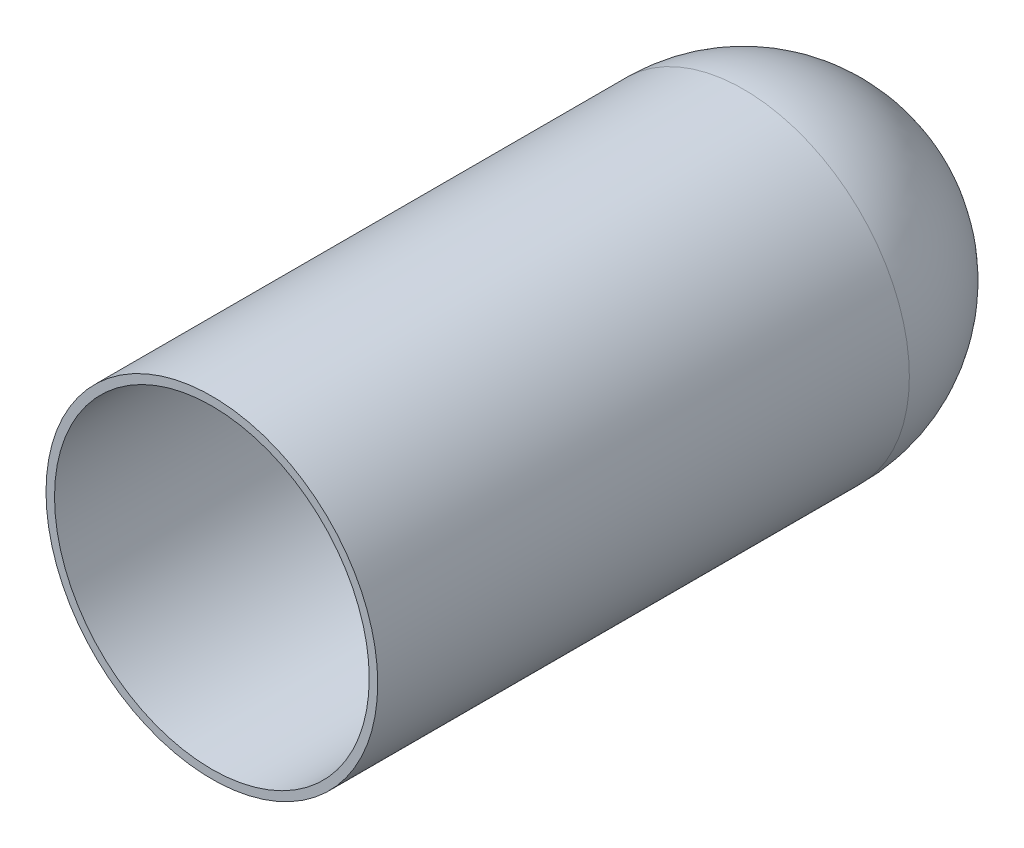
ISO-10303-21;
HEADER;
FILE_DESCRIPTION(('STEP AP214'),'2;1');
FILE_NAME('part.step','',(''),(''),'','','');
FILE_SCHEMA(('AUTOMOTIVE_DESIGN { 1 0 10303 214 1 1 1 1 }'));
ENDSEC;
DATA;
#1=APPLICATION_CONTEXT('core data for automotive mechanical design processes');
#2=APPLICATION_PROTOCOL_DEFINITION('international standard','automotive_design',2000,#1);
#3=PRODUCT_CONTEXT('',#1,'mechanical');
#4=PRODUCT('Part','Part','',(#3));
#5=PRODUCT_RELATED_PRODUCT_CATEGORY('part','',(#4));
#6=PRODUCT_DEFINITION_FORMATION('','',#4);
#7=PRODUCT_DEFINITION_CONTEXT('part definition',#1,'design');
#8=PRODUCT_DEFINITION('design','',#6,#7);
#9=PRODUCT_DEFINITION_SHAPE('','',#8);
#10=(LENGTH_UNIT() NAMED_UNIT(*) SI_UNIT(.MILLI.,.METRE.));
#11=(NAMED_UNIT(*) PLANE_ANGLE_UNIT() SI_UNIT($,.RADIAN.));
#12=(NAMED_UNIT(*) SI_UNIT($,.STERADIAN.) SOLID_ANGLE_UNIT());
#13=UNCERTAINTY_MEASURE_WITH_UNIT(LENGTH_MEASURE(1.E-05),#10,'distance_accuracy_value','');
#14=(GEOMETRIC_REPRESENTATION_CONTEXT(3) GLOBAL_UNCERTAINTY_ASSIGNED_CONTEXT((#13)) GLOBAL_UNIT_ASSIGNED_CONTEXT((#10,
#11,#12)) REPRESENTATION_CONTEXT('',''));
#15=CARTESIAN_POINT('',(0.,0.,0.));
#16=DIRECTION('',(0.,0.,1.));
#17=DIRECTION('',(1.,0.,0.));
#18=AXIS2_PLACEMENT_3D('',#15,#16,#17);
#19=CARTESIAN_POINT('',(0.,0.,31.25));
#20=DIRECTION('',(0.,0.,-1.));
#21=DIRECTION('',(-1.,0.,0.));
#22=AXIS2_PLACEMENT_3D('',#19,#20,#21);
#23=CYLINDRICAL_SURFACE('',#22,9.75000000000001);
#24=CARTESIAN_POINT('',(0.,0.,31.25));
#25=DIRECTION('',(0.,0.,1.));
#26=DIRECTION('',(1.,0.,0.));
#27=AXIS2_PLACEMENT_3D('',#24,#25,#26);
#28=CIRCLE('',#27,9.75000000000001);
#29=CARTESIAN_POINT('',(9.75000000000001,0.,31.25));
#30=VERTEX_POINT('',#29);
#31=EDGE_CURVE('E10',#30,#30,#28,.T.);
#32=ORIENTED_EDGE('',*,*,#31,.F.);
#33=EDGE_LOOP('',(#32));
#34=FACE_BOUND('',#33,.T.);
#35=CARTESIAN_POINT('',(0.,0.,0.));
#36=DIRECTION('',(0.,0.,1.));
#37=DIRECTION('',(1.,0.,0.));
#38=AXIS2_PLACEMENT_3D('',#35,#36,#37);
#39=CIRCLE('',#38,9.75000000000001);
#40=CARTESIAN_POINT('',(9.75000000000001,0.,0.));
#41=VERTEX_POINT('',#40);
#42=EDGE_CURVE('E48',#41,#41,#39,.T.);
#43=ORIENTED_EDGE('',*,*,#42,.T.);
#44=EDGE_LOOP('',(#43));
#45=FACE_BOUND('',#44,.T.);
#46=ADVANCED_FACE('F44',(#34,#45),#23,.T.);
#47=CARTESIAN_POINT('',(0.,0.,31.25));
#48=DIRECTION('',(0.,0.,1.));
#49=DIRECTION('',(1.,0.,0.));
#50=AXIS2_PLACEMENT_3D('',#47,#48,#49);
#51=PLANE('',#50);
#52=CARTESIAN_POINT('',(0.,0.,31.25));
#53=DIRECTION('',(0.,0.,1.));
#54=DIRECTION('',(1.,0.,0.));
#55=AXIS2_PLACEMENT_3D('',#52,#53,#54);
#56=CIRCLE('',#55,9.25000000000001);
#57=CARTESIAN_POINT('',(9.25000000000001,0.,31.25));
#58=VERTEX_POINT('',#57);
#59=EDGE_CURVE('E57',#58,#58,#56,.T.);
#60=ORIENTED_EDGE('',*,*,#59,.F.);
#61=EDGE_LOOP('',(#60));
#62=FACE_BOUND('',#61,.T.);
#63=ORIENTED_EDGE('',*,*,#31,.T.);
#64=EDGE_LOOP('',(#63));
#65=FACE_BOUND('',#64,.T.);
#66=ADVANCED_FACE('F78',(#62,#65),#51,.T.);
#67=CARTESIAN_POINT('',(0.,0.,0.));
#68=DIRECTION('',(0.,0.,1.));
#69=DIRECTION('',(1.,0.,0.));
#70=AXIS2_PLACEMENT_3D('',#67,#68,#69);
#71=SPHERICAL_SURFACE('',#70,9.75000000000001);
#72=ORIENTED_EDGE('',*,*,#42,.F.);
#73=EDGE_LOOP('',(#72));
#74=FACE_BOUND('',#73,.T.);
#75=ADVANCED_FACE('F46',(#74),#71,.T.);
#76=CARTESIAN_POINT('',(0.,0.,31.25));
#77=DIRECTION('',(0.,0.,-1.));
#78=DIRECTION('',(-1.,0.,0.));
#79=AXIS2_PLACEMENT_3D('',#76,#77,#78);
#80=CYLINDRICAL_SURFACE('',#79,9.25000000000001);
#81=ORIENTED_EDGE('',*,*,#59,.T.);
#82=EDGE_LOOP('',(#81));
#83=FACE_BOUND('',#82,.T.);
#84=CARTESIAN_POINT('',(0.,0.,0.));
#85=DIRECTION('',(0.,0.,-1.));
#86=DIRECTION('',(-1.,0.,0.));
#87=AXIS2_PLACEMENT_3D('',#84,#85,#86);
#88=CIRCLE('',#87,9.25000000000001);
#89=CARTESIAN_POINT('',(-9.25000000000001,0.,0.));
#90=VERTEX_POINT('',#89);
#91=EDGE_CURVE('E62',#90,#90,#88,.F.);
#92=ORIENTED_EDGE('',*,*,#91,.F.);
#93=EDGE_LOOP('',(#92));
#94=FACE_BOUND('',#93,.T.);
#95=ADVANCED_FACE('F69',(#83,#94),#80,.F.);
#96=CARTESIAN_POINT('',(0.,0.,0.));
#97=DIRECTION('',(0.,0.,1.));
#98=DIRECTION('',(1.,0.,0.));
#99=AXIS2_PLACEMENT_3D('',#96,#97,#98);
#100=SPHERICAL_SURFACE('',#99,9.25000000000001);
#101=ORIENTED_EDGE('',*,*,#91,.T.);
#102=EDGE_LOOP('',(#101));
#103=FACE_BOUND('',#102,.T.);
#104=ADVANCED_FACE('F67',(#103),#100,.F.);
#105=CLOSED_SHELL('',(#46,#66,#75,#95,#104));
#106=MANIFOLD_SOLID_BREP('B2',#105);
#107=ADVANCED_BREP_SHAPE_REPRESENTATION('',(#18,#106),#14);
#108=SHAPE_DEFINITION_REPRESENTATION(#9,#107);
ENDSEC;
END-ISO-10303-21;
